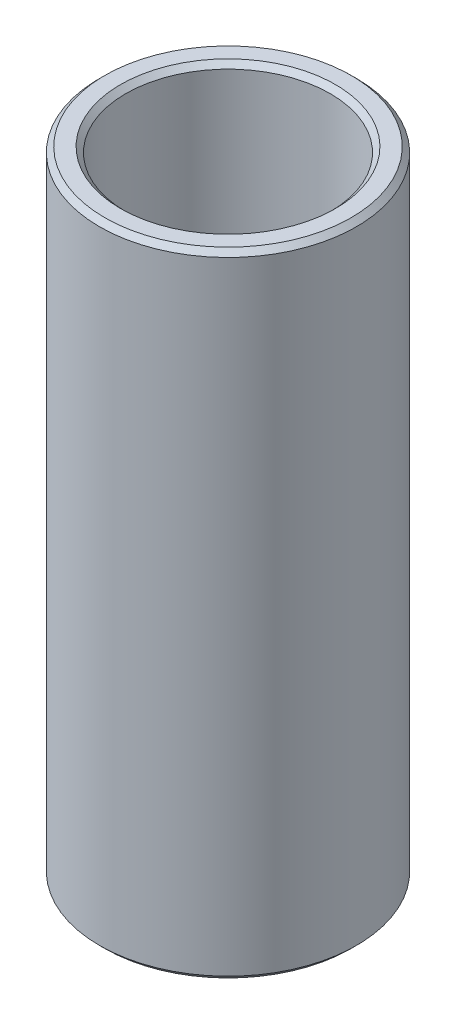
ISO-10303-21;
HEADER;
FILE_DESCRIPTION(('STEP AP214'),'2;1');
FILE_NAME('part.step','',(''),(''),'','','');
FILE_SCHEMA(('AUTOMOTIVE_DESIGN { 1 0 10303 214 1 1 1 1 }'));
ENDSEC;
DATA;
#1=APPLICATION_CONTEXT('core data for automotive mechanical design processes');
#2=APPLICATION_PROTOCOL_DEFINITION('international standard','automotive_design',2000,#1);
#3=PRODUCT_CONTEXT('',#1,'mechanical');
#4=PRODUCT('Part','Part','',(#3));
#5=PRODUCT_RELATED_PRODUCT_CATEGORY('part','',(#4));
#6=PRODUCT_DEFINITION_FORMATION('','',#4);
#7=PRODUCT_DEFINITION_CONTEXT('part definition',#1,'design');
#8=PRODUCT_DEFINITION('design','',#6,#7);
#9=PRODUCT_DEFINITION_SHAPE('','',#8);
#10=(LENGTH_UNIT() NAMED_UNIT(*) SI_UNIT(.MILLI.,.METRE.));
#11=(NAMED_UNIT(*) PLANE_ANGLE_UNIT() SI_UNIT($,.RADIAN.));
#12=(NAMED_UNIT(*) SI_UNIT($,.STERADIAN.) SOLID_ANGLE_UNIT());
#13=UNCERTAINTY_MEASURE_WITH_UNIT(LENGTH_MEASURE(1.E-05),#10,'distance_accuracy_value','');
#14=(GEOMETRIC_REPRESENTATION_CONTEXT(3) GLOBAL_UNCERTAINTY_ASSIGNED_CONTEXT((#13)) GLOBAL_UNIT_ASSIGNED_CONTEXT((#10,
#11,#12)) REPRESENTATION_CONTEXT('',''));
#15=CARTESIAN_POINT('',(0.,0.,0.));
#16=DIRECTION('',(0.,0.,1.));
#17=DIRECTION('',(1.,0.,0.));
#18=AXIS2_PLACEMENT_3D('',#15,#16,#17);
#19=CARTESIAN_POINT('',(0.,110.848872892169,0.));
#20=DIRECTION('',(0.,-1.,0.));
#21=DIRECTION('',(0.,0.,-1.));
#22=AXIS2_PLACEMENT_3D('',#19,#20,#21);
#23=CYLINDRICAL_SURFACE('',#22,22.5);
#24=CARTESIAN_POINT('',(0.,0.916934644604767,0.));
#25=DIRECTION('',(0.,1.,0.));
#26=DIRECTION('',(0.,0.,1.));
#27=AXIS2_PLACEMENT_3D('',#24,#25,#26);
#28=CIRCLE('',#27,22.5);
#29=CARTESIAN_POINT('',(0.,0.916934644604766,22.5));
#30=VERTEX_POINT('',#29);
#31=EDGE_CURVE('E10',#30,#30,#28,.T.);
#32=ORIENTED_EDGE('',*,*,#31,.T.);
#33=EDGE_LOOP('',(#32));
#34=FACE_BOUND('',#33,.T.);
#35=CARTESIAN_POINT('',(0.,109.931938247564,0.));
#36=DIRECTION('',(0.,1.,0.));
#37=DIRECTION('',(0.,0.,1.));
#38=AXIS2_PLACEMENT_3D('',#35,#36,#37);
#39=CIRCLE('',#38,22.5);
#40=CARTESIAN_POINT('',(0.,109.931938247564,22.5));
#41=VERTEX_POINT('',#40);
#42=EDGE_CURVE('E50',#41,#41,#39,.F.);
#43=ORIENTED_EDGE('',*,*,#42,.T.);
#44=EDGE_LOOP('',(#43));
#45=FACE_BOUND('',#44,.T.);
#46=ADVANCED_FACE('F39',(#34,#45),#23,.T.);
#47=CARTESIAN_POINT('',(0.,110.848872892169,0.));
#48=DIRECTION('',(0.,1.,0.));
#49=DIRECTION('',(0.,0.,1.));
#50=AXIS2_PLACEMENT_3D('',#47,#48,#49);
#51=PLANE('',#50);
#52=CARTESIAN_POINT('',(0.,110.848872892169,0.));
#53=DIRECTION('',(0.,1.,0.));
#54=DIRECTION('',(0.,0.,1.));
#55=AXIS2_PLACEMENT_3D('',#52,#53,#54);
#56=CIRCLE('',#55,18.8200382505709);
#57=CARTESIAN_POINT('',(0.,110.848872892169,18.8200382505709));
#58=VERTEX_POINT('',#57);
#59=EDGE_CURVE('E58',#58,#58,#56,.F.);
#60=ORIENTED_EDGE('',*,*,#59,.T.);
#61=EDGE_LOOP('',(#60));
#62=FACE_BOUND('',#61,.T.);
#63=CARTESIAN_POINT('',(0.,110.848872892169,0.));
#64=DIRECTION('',(0.,1.,0.));
#65=DIRECTION('',(0.,0.,1.));
#66=AXIS2_PLACEMENT_3D('',#63,#64,#65);
#67=CIRCLE('',#66,21.5830653553952);
#68=CARTESIAN_POINT('',(0.,110.848872892169,21.5830653553952));
#69=VERTEX_POINT('',#68);
#70=EDGE_CURVE('E61',#69,#69,#67,.T.);
#71=ORIENTED_EDGE('',*,*,#70,.T.);
#72=EDGE_LOOP('',(#71));
#73=FACE_BOUND('',#72,.T.);
#74=ADVANCED_FACE('F88',(#62,#73),#51,.T.);
#75=CARTESIAN_POINT('',(0.,0.,0.));
#76=DIRECTION('',(0.,1.,0.));
#77=DIRECTION('',(0.,0.,1.));
#78=AXIS2_PLACEMENT_3D('',#75,#76,#77);
#79=PLANE('',#78);
#80=CARTESIAN_POINT('',(0.,0.,0.));
#81=DIRECTION('',(0.,1.,0.));
#82=DIRECTION('',(0.,0.,1.));
#83=AXIS2_PLACEMENT_3D('',#80,#81,#82);
#84=CIRCLE('',#83,18.8200382505709);
#85=CARTESIAN_POINT('',(0.,0.,-18.8200382505709));
#86=VERTEX_POINT('',#85);
#87=EDGE_CURVE('E51',#86,#86,#84,.T.);
#88=ORIENTED_EDGE('',*,*,#87,.T.);
#89=EDGE_LOOP('',(#88));
#90=FACE_BOUND('',#89,.T.);
#91=CARTESIAN_POINT('',(0.,0.,0.));
#92=DIRECTION('',(0.,1.,0.));
#93=DIRECTION('',(0.,0.,1.));
#94=AXIS2_PLACEMENT_3D('',#91,#92,#93);
#95=CIRCLE('',#94,21.5830653553952);
#96=CARTESIAN_POINT('',(0.,0.,21.5830653553952));
#97=VERTEX_POINT('',#96);
#98=EDGE_CURVE('E54',#97,#97,#95,.F.);
#99=ORIENTED_EDGE('',*,*,#98,.T.);
#100=EDGE_LOOP('',(#99));
#101=FACE_BOUND('',#100,.T.);
#102=ADVANCED_FACE('F83',(#90,#101),#79,.F.);
#103=CARTESIAN_POINT('',(0.,110.848872892169,0.));
#104=DIRECTION('',(0.,-1.,0.));
#105=DIRECTION('',(0.,0.,-1.));
#106=AXIS2_PLACEMENT_3D('',#103,#104,#105);
#107=CYLINDRICAL_SURFACE('',#106,17.9031036059662);
#108=CARTESIAN_POINT('',(0.,109.931938247564,0.));
#109=DIRECTION('',(0.,1.,0.));
#110=DIRECTION('',(0.,0.,1.));
#111=AXIS2_PLACEMENT_3D('',#108,#109,#110);
#112=CIRCLE('',#111,17.9031036059662);
#113=CARTESIAN_POINT('',(0.,109.931938247564,17.9031036059662));
#114=VERTEX_POINT('',#113);
#115=EDGE_CURVE('E67',#114,#114,#112,.T.);
#116=ORIENTED_EDGE('',*,*,#115,.T.);
#117=EDGE_LOOP('',(#116));
#118=FACE_BOUND('',#117,.T.);
#119=CARTESIAN_POINT('',(0.,0.916934644604739,0.));
#120=DIRECTION('',(0.,1.,0.));
#121=DIRECTION('',(0.,0.,1.));
#122=AXIS2_PLACEMENT_3D('',#119,#120,#121);
#123=CIRCLE('',#122,17.9031036059662);
#124=CARTESIAN_POINT('',(0.,0.916934644604739,-17.9031036059662));
#125=VERTEX_POINT('',#124);
#126=EDGE_CURVE('E69',#125,#125,#123,.F.);
#127=ORIENTED_EDGE('',*,*,#126,.T.);
#128=EDGE_LOOP('',(#127));
#129=FACE_BOUND('',#128,.T.);
#130=ADVANCED_FACE('F71',(#118,#129),#107,.F.);
#131=CARTESIAN_POINT('',(0.,109.931938247564,0.));
#132=DIRECTION('',(0.,1.,0.));
#133=DIRECTION('',(0.,0.,1.));
#134=AXIS2_PLACEMENT_3D('',#131,#132,#133);
#135=CONICAL_SURFACE('',#134,17.9031036059662,0.78539816339745);
#136=ORIENTED_EDGE('',*,*,#59,.F.);
#137=EDGE_LOOP('',(#136));
#138=FACE_BOUND('',#137,.T.);
#139=ORIENTED_EDGE('',*,*,#115,.F.);
#140=EDGE_LOOP('',(#139));
#141=FACE_BOUND('',#140,.T.);
#142=ADVANCED_FACE('F77',(#138,#141),#135,.F.);
#143=CARTESIAN_POINT('',(0.,0.,0.));
#144=DIRECTION('',(0.,-1.,0.));
#145=DIRECTION('',(0.,0.,-1.));
#146=AXIS2_PLACEMENT_3D('',#143,#144,#145);
#147=CONICAL_SURFACE('',#146,18.8200382505709,0.78539816339745);
#148=CARTESIAN_POINT('',(0.,0.916934644604739,-17.9031036059662));
#149=CARTESIAN_POINT('',(0.,0.907383242056773,-17.9126550085141));
#150=CARTESIAN_POINT('',(0.,0.897831839508807,-17.9222064110621));
#151=CARTESIAN_POINT('',(0.,0.878729034412875,-17.941309216158));
#152=CARTESIAN_POINT('',(0.,0.869177631864909,-17.950860618706));
#153=CARTESIAN_POINT('',(0.,0.850074826768977,-17.9699634238019));
#154=CARTESIAN_POINT('',(0.,0.84052342422101,-17.9795148263499));
#155=CARTESIAN_POINT('',(0.,0.821420619125078,-17.9986176314458));
#156=CARTESIAN_POINT('',(0.,0.811869216577112,-18.0081690339938));
#157=CARTESIAN_POINT('',(0.,0.79276641148118,-18.0272718390897));
#158=CARTESIAN_POINT('',(0.,0.783215008933214,-18.0368232416377));
#159=CARTESIAN_POINT('',(0.,0.764112203837282,-18.0559260467336));
#160=CARTESIAN_POINT('',(0.,0.754560801289316,-18.0654774492816));
#161=CARTESIAN_POINT('',(0.,0.735457996193384,-18.0845802543775));
#162=CARTESIAN_POINT('',(0.,0.725906593645418,-18.0941316569255));
#163=CARTESIAN_POINT('',(0.,0.706803788549486,-18.1132344620214));
#164=CARTESIAN_POINT('',(0.,0.69725238600152,-18.1227858645694));
#165=CARTESIAN_POINT('',(0.,0.678149580905588,-18.1418886696653));
#166=CARTESIAN_POINT('',(0.,0.668598178357622,-18.1514400722133));
#167=CARTESIAN_POINT('',(0.,0.64949537326169,-18.1705428773092));
#168=CARTESIAN_POINT('',(0.,0.639943970713724,-18.1800942798572));
#169=CARTESIAN_POINT('',(0.,0.620841165617792,-18.1991970849531));
#170=CARTESIAN_POINT('',(0.,0.611289763069826,-18.2087484875011));
#171=CARTESIAN_POINT('',(0.,0.592186957973894,-18.227851292597));
#172=CARTESIAN_POINT('',(0.,0.582635555425928,-18.237402695145));
#173=CARTESIAN_POINT('',(0.,0.563532750329996,-18.2565055002409));
#174=CARTESIAN_POINT('',(0.,0.55398134778203,-18.2660569027889));
#175=CARTESIAN_POINT('',(0.,0.534878542686098,-18.2851597078848));
#176=CARTESIAN_POINT('',(0.,0.525327140138132,-18.2947111104328));
#177=CARTESIAN_POINT('',(0.,0.506224335042199,-18.3138139155287));
#178=CARTESIAN_POINT('',(0.,0.496672932494233,-18.3233653180767));
#179=CARTESIAN_POINT('',(0.,0.477570127398301,-18.3424681231726));
#180=CARTESIAN_POINT('',(0.,0.468018724850336,-18.3520195257206));
#181=CARTESIAN_POINT('',(0.,0.448915919754404,-18.3711223308165));
#182=CARTESIAN_POINT('',(0.,0.439364517206437,-18.3806737333645));
#183=CARTESIAN_POINT('',(0.,0.420261712110505,-18.3997765384604));
#184=CARTESIAN_POINT('',(0.,0.410710309562539,-18.4093279410084));
#185=CARTESIAN_POINT('',(0.,0.391607504466607,-18.4284307461043));
#186=CARTESIAN_POINT('',(0.,0.382056101918641,-18.4379821486523));
#187=CARTESIAN_POINT('',(0.,0.362953296822709,-18.4570849537482));
#188=CARTESIAN_POINT('',(0.,0.353401894274743,-18.4666363562962));
#189=CARTESIAN_POINT('',(0.,0.334299089178811,-18.4857391613921));
#190=CARTESIAN_POINT('',(0.,0.324747686630845,-18.4952905639401));
#191=CARTESIAN_POINT('',(0.,0.305644881534913,-18.514393369036));
#192=CARTESIAN_POINT('',(0.,0.296093478986947,-18.523944771584));
#193=CARTESIAN_POINT('',(0.,0.276990673891015,-18.5430475766799));
#194=CARTESIAN_POINT('',(0.,0.267439271343049,-18.5525989792279));
#195=CARTESIAN_POINT('',(0.,0.248336466247117,-18.5717017843238));
#196=CARTESIAN_POINT('',(0.,0.238785063699151,-18.5812531868718));
#197=CARTESIAN_POINT('',(0.,0.219682258603219,-18.6003559919677));
#198=CARTESIAN_POINT('',(0.,0.210130856055253,-18.6099073945157));
#199=CARTESIAN_POINT('',(0.,0.191028050959321,-18.6290101996116));
#200=CARTESIAN_POINT('',(0.,0.181476648411355,-18.6385616021596));
#201=CARTESIAN_POINT('',(0.,0.162373843315422,-18.6576644072555));
#202=CARTESIAN_POINT('',(0.,0.152822440767456,-18.6672158098035));
#203=CARTESIAN_POINT('',(0.,0.133719635671524,-18.6863186148994));
#204=CARTESIAN_POINT('',(0.,0.124168233123558,-18.6958700174474));
#205=CARTESIAN_POINT('',(0.,0.105065428027626,-18.7149728225433));
#206=CARTESIAN_POINT('',(0.,0.0955140254796603,-18.7245242250913));
#207=CARTESIAN_POINT('',(0.,0.0764112203837282,-18.7436270301872));
#208=CARTESIAN_POINT('',(0.,0.0668598178357622,-18.7531784327352));
#209=CARTESIAN_POINT('',(0.,0.0477570127398301,-18.7722812378311));
#210=CARTESIAN_POINT('',(0.,0.0382056101918641,-18.7818326403791));
#211=CARTESIAN_POINT('',(0.,0.0191028050959321,-18.800935445475));
#212=CARTESIAN_POINT('',(0.,0.00955140254796603,-18.810486848023));
#213=CARTESIAN_POINT('',(0.,0.,-18.8200382505709));
#214=B_SPLINE_CURVE_WITH_KNOTS('',3,(#148,#149,#150,#151,#152,#153,#154,#155,#156,#157,#158,
#159,#160,#161,#162,#163,#164,#165,#166,#167,#168,#169,#170,#171,#172,#173,#174,#175,#176,#177,
#178,#179,#180,#181,#182,#183,#184,#185,#186,#187,#188,#189,#190,#191,#192,#193,#194,#195,#196,
#197,#198,#199,#200,#201,#202,#203,#204,#205,#206,#207,#208,#209,#210,#211,#212,#213),
.UNSPECIFIED.,.F.,.F.,(4,2,2,2,2,2,2,2,2,2,2,2,2,2,2,2,2,2,2,2,2,2,2,2,2,2,2,2,2,2,2,2,4),(0.,
0.0405231690690555,0.081046338138111,0.121569507207166,0.162092676276222,0.202615845345277,
0.243139014414333,0.283662183483388,0.324185352552444,0.364708521621499,0.405231690690555,
0.44575485975961,0.486278028828666,0.526801197897722,0.567324366966777,0.607847536035832,
0.64837070510489,0.688893874173946,0.729417043243001,0.769940212312057,0.810463381381112,
0.850986550450168,0.891509719519223,0.932032888588279,0.972556057657334,1.01307922672639,
1.05360239579545,1.0941255648645,1.13464873393356,1.17517190300261,1.21569507207167,
1.25621824114072,1.29674141020978),.UNSPECIFIED.);
#215=EDGE_CURVE('BSEAM73',#125,#86,#214,.T.);
#216=ORIENTED_EDGE('',*,*,#126,.F.);
#217=ORIENTED_EDGE('',*,*,#87,.F.);
#218=ORIENTED_EDGE('',*,*,#215,.T.);
#219=ORIENTED_EDGE('',*,*,#215,.F.);
#220=EDGE_LOOP('',(#216,#218,#217,#219));
#221=FACE_BOUND('',#220,.T.);
#222=ADVANCED_FACE('F73',(#221),#147,.F.);
#223=CARTESIAN_POINT('',(0.,0.916934644604767,0.));
#224=DIRECTION('',(0.,1.,0.));
#225=DIRECTION('',(0.,0.,1.));
#226=AXIS2_PLACEMENT_3D('',#223,#224,#225);
#227=CONICAL_SURFACE('',#226,22.5,0.785398163397448);
#228=CARTESIAN_POINT('',(0.,0.,21.5830653553952));
#229=CARTESIAN_POINT('',(0.,0.00955140254796581,21.5926167579432));
#230=CARTESIAN_POINT('',(0.,0.0191028050959323,21.6021681604912));
#231=CARTESIAN_POINT('',(0.,0.0382056101918654,21.6212709655871));
#232=CARTESIAN_POINT('',(0.,0.0477570127398319,21.6308223681351));
#233=CARTESIAN_POINT('',(0.,0.0668598178357643,21.649925173231));
#234=CARTESIAN_POINT('',(0.,0.0764112203837302,21.659476575779));
#235=CARTESIAN_POINT('',(0.,0.0955140254796627,21.6785793808749));
#236=CARTESIAN_POINT('',(0.,0.105065428027629,21.6881307834229));
#237=CARTESIAN_POINT('',(0.,0.124168233123562,21.7072335885188));
#238=CARTESIAN_POINT('',(0.,0.133719635671528,21.7167849910668));
#239=CARTESIAN_POINT('',(0.,0.152822440767461,21.7358877961627));
#240=CARTESIAN_POINT('',(0.,0.162373843315428,21.7454391987107));
#241=CARTESIAN_POINT('',(0.,0.18147664841136,21.7645420038066));
#242=CARTESIAN_POINT('',(0.,0.191028050959326,21.7740934063546));
#243=CARTESIAN_POINT('',(0.,0.210130856055259,21.7931962114505));
#244=CARTESIAN_POINT('',(0.,0.219682258603225,21.8027476139985));
#245=CARTESIAN_POINT('',(0.,0.238785063699158,21.8218504190944));
#246=CARTESIAN_POINT('',(0.,0.248336466247124,21.8314018216424));
#247=CARTESIAN_POINT('',(0.,0.267439271343057,21.8505046267383));
#248=CARTESIAN_POINT('',(0.,0.276990673891023,21.8600560292863));
#249=CARTESIAN_POINT('',(0.,0.296093478986956,21.8791588343822));
#250=CARTESIAN_POINT('',(0.,0.305644881534922,21.8887102369302));
#251=CARTESIAN_POINT('',(0.,0.324747686630854,21.9078130420261));
#252=CARTESIAN_POINT('',(0.,0.334299089178821,21.9173644445741));
#253=CARTESIAN_POINT('',(0.,0.353401894274754,21.93646724967));
#254=CARTESIAN_POINT('',(0.,0.36295329682272,21.946018652218));
#255=CARTESIAN_POINT('',(0.,0.382056101918653,21.9651214573139));
#256=CARTESIAN_POINT('',(0.,0.391607504466619,21.9746728598619));
#257=CARTESIAN_POINT('',(0.,0.410710309562552,21.9937756649578));
#258=CARTESIAN_POINT('',(0.,0.420261712110518,22.0033270675058));
#259=CARTESIAN_POINT('',(0.,0.43936451720645,22.0224298726017));
#260=CARTESIAN_POINT('',(0.,0.448915919754417,22.0319812751497));
#261=CARTESIAN_POINT('',(0.,0.46801872485035,22.0510840802456));
#262=CARTESIAN_POINT('',(0.,0.477570127398316,22.0606354827936));
#263=CARTESIAN_POINT('',(0.,0.496672932494249,22.0797382878895));
#264=CARTESIAN_POINT('',(0.,0.506224335042215,22.0892896904374));
#265=CARTESIAN_POINT('',(0.,0.525327140138148,22.1083924955334));
#266=CARTESIAN_POINT('',(0.,0.534878542686114,22.1179438980814));
#267=CARTESIAN_POINT('',(0.,0.553981347782046,22.1370467031773));
#268=CARTESIAN_POINT('',(0.,0.563532750330013,22.1465981057252));
#269=CARTESIAN_POINT('',(0.,0.582635555425946,22.1657009108212));
#270=CARTESIAN_POINT('',(0.,0.592186957973912,22.1752523133691));
#271=CARTESIAN_POINT('',(0.,0.611289763069845,22.1943551184651));
#272=CARTESIAN_POINT('',(0.,0.620841165617811,22.203906521013));
#273=CARTESIAN_POINT('',(0.,0.639943970713744,22.223009326109));
#274=CARTESIAN_POINT('',(0.,0.649495373261709,22.2325607286569));
#275=CARTESIAN_POINT('',(0.,0.668598178357642,22.2516635337529));
#276=CARTESIAN_POINT('',(0.,0.678149580905609,22.2612149363008));
#277=CARTESIAN_POINT('',(0.,0.697252386001541,22.2803177413968));
#278=CARTESIAN_POINT('',(0.,0.706803788549507,22.2898691439447));
#279=CARTESIAN_POINT('',(0.,0.72590659364544,22.3089719490407));
#280=CARTESIAN_POINT('',(0.,0.735457996193407,22.3185233515886));
#281=CARTESIAN_POINT('',(0.,0.754560801289339,22.3376261566846));
#282=CARTESIAN_POINT('',(0.,0.764112203837305,22.3471775592325));
#283=CARTESIAN_POINT('',(0.,0.783215008933238,22.3662803643285));
#284=CARTESIAN_POINT('',(0.,0.792766411481204,22.3758317668764));
#285=CARTESIAN_POINT('',(0.,0.811869216577137,22.3949345719724));
#286=CARTESIAN_POINT('',(0.,0.821420619125103,22.4044859745203));
#287=CARTESIAN_POINT('',(0.,0.840523424221036,22.4235887796163));
#288=CARTESIAN_POINT('',(0.,0.850074826769003,22.4331401821642));
#289=CARTESIAN_POINT('',(0.,0.869177631864935,22.4522429872602));
#290=CARTESIAN_POINT('',(0.,0.878729034412901,22.4617943898081));
#291=CARTESIAN_POINT('',(0.,0.897831839508833,22.4808971949041));
#292=CARTESIAN_POINT('',(0.,0.907383242056799,22.490448597452));
#293=CARTESIAN_POINT('',(0.,0.916934644604766,22.5));
#294=B_SPLINE_CURVE_WITH_KNOTS('',3,(#228,#229,#230,#231,#232,#233,#234,#235,#236,#237,#238,
#239,#240,#241,#242,#243,#244,#245,#246,#247,#248,#249,#250,#251,#252,#253,#254,#255,#256,#257,
#258,#259,#260,#261,#262,#263,#264,#265,#266,#267,#268,#269,#270,#271,#272,#273,#274,#275,#276,
#277,#278,#279,#280,#281,#282,#283,#284,#285,#286,#287,#288,#289,#290,#291,#292,#293),
.UNSPECIFIED.,.F.,.F.,(4,2,2,2,2,2,2,2,2,2,2,2,2,2,2,2,2,2,2,2,2,2,2,2,2,2,2,2,2,2,2,2,4),(0.,
0.0405231690690561,0.0810463381381122,0.121569507207171,0.162092676276227,0.202615845345283,
0.243139014414339,0.283662183483398,0.324185352552454,0.36470852162151,0.405231690690566,
0.445754859759624,0.486278028828681,0.526801197897737,0.567324366966793,0.607847536035851,
0.648370705104907,0.688893874173963,0.729417043243019,0.769940212312078,0.810463381381134,
0.85098655045019,0.891509719519246,0.932032888588305,0.972556057657361,1.01307922672642,
1.05360239579547,1.09412556486453,1.13464873393359,1.17517190300264,1.2156950720717,
1.25621824114076,1.29674141020981),.UNSPECIFIED.);
#295=EDGE_CURVE('BSEAM76',#97,#30,#294,.T.);
#296=ORIENTED_EDGE('',*,*,#98,.F.);
#297=ORIENTED_EDGE('',*,*,#31,.F.);
#298=ORIENTED_EDGE('',*,*,#295,.T.);
#299=ORIENTED_EDGE('',*,*,#295,.F.);
#300=EDGE_LOOP('',(#296,#298,#297,#299));
#301=FACE_BOUND('',#300,.T.);
#302=ADVANCED_FACE('F76',(#301),#227,.T.);
#303=CARTESIAN_POINT('',(0.,110.848872892169,0.));
#304=DIRECTION('',(0.,-1.,0.));
#305=DIRECTION('',(0.,0.,-1.));
#306=AXIS2_PLACEMENT_3D('',#303,#304,#305);
#307=CONICAL_SURFACE('',#306,21.5830653553952,0.785398163397452);
#308=ORIENTED_EDGE('',*,*,#42,.F.);
#309=EDGE_LOOP('',(#308));
#310=FACE_BOUND('',#309,.T.);
#311=ORIENTED_EDGE('',*,*,#70,.F.);
#312=EDGE_LOOP('',(#311));
#313=FACE_BOUND('',#312,.T.);
#314=ADVANCED_FACE('F45',(#310,#313),#307,.T.);
#315=CLOSED_SHELL('',(#46,#74,#102,#130,#142,#222,#302,#314));
#316=MANIFOLD_SOLID_BREP('B2',#315);
#317=ADVANCED_BREP_SHAPE_REPRESENTATION('',(#18,#316),#14);
#318=SHAPE_DEFINITION_REPRESENTATION(#9,#317);
ENDSEC;
END-ISO-10303-21;
